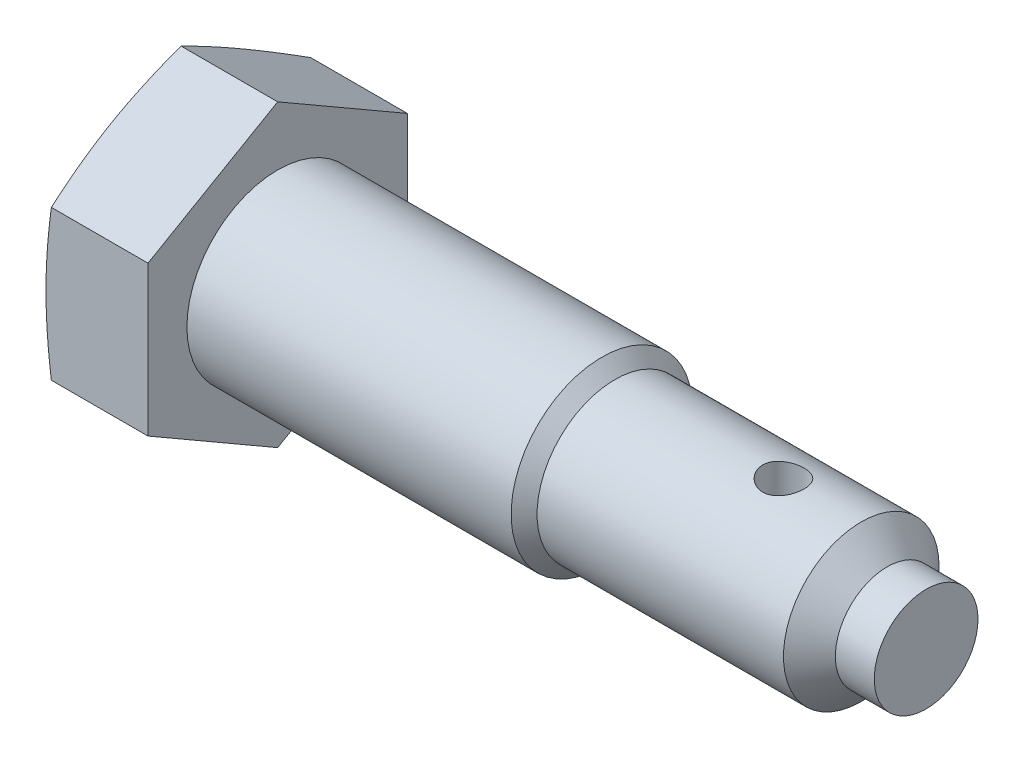
ISO-10303-21;
HEADER;
FILE_DESCRIPTION(('STEP AP214'),'2;1');
FILE_NAME('part.step','',(''),(''),'','','');
FILE_SCHEMA(('AUTOMOTIVE_DESIGN { 1 0 10303 214 1 1 1 1 }'));
ENDSEC;
DATA;
#1=APPLICATION_CONTEXT('core data for automotive mechanical design processes');
#2=APPLICATION_PROTOCOL_DEFINITION('international standard','automotive_design',2000,#1);
#3=PRODUCT_CONTEXT('',#1,'mechanical');
#4=PRODUCT('Part','Part','',(#3));
#5=PRODUCT_RELATED_PRODUCT_CATEGORY('part','',(#4));
#6=PRODUCT_DEFINITION_FORMATION('','',#4);
#7=PRODUCT_DEFINITION_CONTEXT('part definition',#1,'design');
#8=PRODUCT_DEFINITION('design','',#6,#7);
#9=PRODUCT_DEFINITION_SHAPE('','',#8);
#10=(LENGTH_UNIT() NAMED_UNIT(*) SI_UNIT(.MILLI.,.METRE.));
#11=(NAMED_UNIT(*) PLANE_ANGLE_UNIT() SI_UNIT($,.RADIAN.));
#12=(NAMED_UNIT(*) SI_UNIT($,.STERADIAN.) SOLID_ANGLE_UNIT());
#13=UNCERTAINTY_MEASURE_WITH_UNIT(LENGTH_MEASURE(1.E-05),#10,'distance_accuracy_value','');
#14=(GEOMETRIC_REPRESENTATION_CONTEXT(3) GLOBAL_UNCERTAINTY_ASSIGNED_CONTEXT((#13)) GLOBAL_UNIT_ASSIGNED_CONTEXT((#10,
#11,#12)) REPRESENTATION_CONTEXT('',''));
#15=CARTESIAN_POINT('',(0.,0.,0.));
#16=DIRECTION('',(0.,0.,1.));
#17=DIRECTION('',(1.,0.,0.));
#18=AXIS2_PLACEMENT_3D('',#15,#16,#17);
#19=CARTESIAN_POINT('',(0.,0.,0.));
#20=DIRECTION('',(1.,0.,0.));
#21=DIRECTION('',(0.,0.,-1.));
#22=AXIS2_PLACEMENT_3D('',#19,#20,#21);
#23=CYLINDRICAL_SURFACE('',#22,3.5);
#24=CARTESIAN_POINT('',(0.,0.,0.));
#25=DIRECTION('',(-1.,0.,0.));
#26=DIRECTION('',(0.,0.,1.));
#27=AXIS2_PLACEMENT_3D('',#24,#25,#26);
#28=CIRCLE('',#27,3.5);
#29=CARTESIAN_POINT('',(0.,0.,3.5));
#30=VERTEX_POINT('',#29);
#31=EDGE_CURVE('E121',#30,#30,#28,.F.);
#32=ORIENTED_EDGE('',*,*,#31,.T.);
#33=EDGE_LOOP('',(#32));
#34=FACE_BOUND('',#33,.T.);
#35=CARTESIAN_POINT('',(12.5,0.,0.));
#36=DIRECTION('',(1.,0.,0.));
#37=DIRECTION('',(0.,0.,-1.));
#38=AXIS2_PLACEMENT_3D('',#35,#36,#37);
#39=CIRCLE('',#38,3.5);
#40=CARTESIAN_POINT('',(12.5,0.,-3.5));
#41=VERTEX_POINT('',#40);
#42=EDGE_CURVE('E11',#41,#41,#39,.T.);
#43=ORIENTED_EDGE('',*,*,#42,.F.);
#44=EDGE_LOOP('',(#43));
#45=FACE_BOUND('',#44,.T.);
#46=ADVANCED_FACE('F38',(#34,#45),#23,.T.);
#47=CARTESIAN_POINT('',(13.,0.,0.));
#48=DIRECTION('',(-1.,0.,0.));
#49=DIRECTION('',(0.,0.,1.));
#50=AXIS2_PLACEMENT_3D('',#47,#48,#49);
#51=CONICAL_SURFACE('',#50,3.,0.785398163397473);
#52=ORIENTED_EDGE('',*,*,#42,.T.);
#53=EDGE_LOOP('',(#52));
#54=FACE_BOUND('',#53,.T.);
#55=CARTESIAN_POINT('',(13.,0.,0.));
#56=DIRECTION('',(1.,0.,0.));
#57=DIRECTION('',(0.,0.,-1.));
#58=AXIS2_PLACEMENT_3D('',#55,#56,#57);
#59=CIRCLE('',#58,3.);
#60=CARTESIAN_POINT('',(13.,0.,-3.));
#61=VERTEX_POINT('',#60);
#62=EDGE_CURVE('E50',#61,#61,#59,.T.);
#63=ORIENTED_EDGE('',*,*,#62,.F.);
#64=EDGE_LOOP('',(#63));
#65=FACE_BOUND('',#64,.T.);
#66=ADVANCED_FACE('F215',(#54,#65),#51,.T.);
#67=CARTESIAN_POINT('',(0.,0.,0.));
#68=DIRECTION('',(1.,0.,0.));
#69=DIRECTION('',(0.,0.,-1.));
#70=AXIS2_PLACEMENT_3D('',#67,#68,#69);
#71=CYLINDRICAL_SURFACE('',#70,3.);
#72=CARTESIAN_POINT('',(19.5,-2.89136645896019,0.799999999999999));
#73=CARTESIAN_POINT('',(19.4559296249161,-2.89136722297506,0.799998937264903));
#74=CARTESIAN_POINT('',(19.4118479998448,-2.89238505896883,0.796345972907145));
#75=CARTESIAN_POINT('',(19.3249578314098,-2.89633424540265,0.781858333049021));
#76=CARTESIAN_POINT('',(19.2821499380152,-2.89926655584148,0.77102005448496));
#77=CARTESIAN_POINT('',(19.1990767720099,-2.90668950049836,0.74254338223744));
#78=CARTESIAN_POINT('',(19.1588080164656,-2.91117794268077,0.724914550167945));
#79=CARTESIAN_POINT('',(19.0817933039791,-2.92120461973766,0.683387138255579));
#80=CARTESIAN_POINT('',(19.045047620998,-2.92674293615287,0.659488071366006));
#81=CARTESIAN_POINT('',(18.9752029812041,-2.93840055819835,0.605459391498027));
#82=CARTESIAN_POINT('',(18.942205193014,-2.94453016446161,0.575201190016778));
#83=CARTESIAN_POINT('',(18.8816873692198,-2.95659080575019,0.509589709136142));
#84=CARTESIAN_POINT('',(18.8541679015433,-2.96252182013488,0.474235902138674));
#85=CARTESIAN_POINT('',(18.8049660246388,-2.97363195387254,0.398735268349294));
#86=CARTESIAN_POINT('',(18.7833841925468,-2.97879750504887,0.358520727951789));
#87=CARTESIAN_POINT('',(18.7473261458531,-2.98767650484764,0.274873217891643));
#88=CARTESIAN_POINT('',(18.7328487330874,-2.99139019830513,0.231440792350045));
#89=CARTESIAN_POINT('',(18.7117379119057,-2.99687421430577,0.143646384724038));
#90=CARTESIAN_POINT('',(18.7049324093496,-2.99868710700104,0.0993284896803692));
#91=CARTESIAN_POINT('',(18.6988171519571,-3.00031409847102,0.0101454214034335));
#92=CARTESIAN_POINT('',(18.6995061425479,-3.00012853178644,-0.0347196589754088));
#93=CARTESIAN_POINT('',(18.7082391250158,-2.99781070343906,-0.122525694844536));
#94=CARTESIAN_POINT('',(18.7160971830545,-2.99572765610801,-0.165486640288441));
#95=CARTESIAN_POINT('',(18.7386448551128,-2.98990699436187,-0.249456526228419));
#96=CARTESIAN_POINT('',(18.7533348586744,-2.98616928560232,-0.29046535527223));
#97=CARTESIAN_POINT('',(18.789271939037,-2.97738627639961,-0.36984157805902));
#98=CARTESIAN_POINT('',(18.8105827228403,-2.97232835151086,-0.408178674531815));
#99=CARTESIAN_POINT('',(18.8591075278036,-2.96144987403785,-0.480795999505805));
#100=CARTESIAN_POINT('',(18.8863226996113,-2.95562917289138,-0.515075435234341));
#101=CARTESIAN_POINT('',(18.9468707431736,-2.94364509175552,-0.579714147786241));
#102=CARTESIAN_POINT('',(18.9803657780198,-2.93747667747739,-0.609920768071095));
#103=CARTESIAN_POINT('',(19.0520098704955,-2.92565362009165,-0.664325328419074));
#104=CARTESIAN_POINT('',(19.0901592116801,-2.91999900832316,-0.688522902119217));
#105=CARTESIAN_POINT('',(19.1703600407286,-2.90982360913227,-0.730338716745105));
#106=CARTESIAN_POINT('',(19.2124341403655,-2.90531002840292,-0.747915466402144));
#107=CARTESIAN_POINT('',(19.2990905997818,-2.89801730031578,-0.775696006742653));
#108=CARTESIAN_POINT('',(19.3436723345794,-2.89523772285943,-0.785901625845208));
#109=CARTESIAN_POINT('',(19.4326508844086,-2.89181934257617,-0.798387028371088));
#110=CARTESIAN_POINT('',(19.4770134194443,-2.89111905331079,-0.800894530484869));
#111=CARTESIAN_POINT('',(19.565523909121,-2.89177031401857,-0.798539924492));
#112=CARTESIAN_POINT('',(19.6096718860969,-2.89312164562678,-0.793678600688865));
#113=CARTESIAN_POINT('',(19.695622637639,-2.89766449715693,-0.776925087479655));
#114=CARTESIAN_POINT('',(19.7374541751755,-2.90082015876542,-0.765169791651626));
#115=CARTESIAN_POINT('',(19.8185518525433,-2.90858107584293,-0.735115946901958));
#116=CARTESIAN_POINT('',(19.8578176565708,-2.91318652060286,-0.716816543506621));
#117=CARTESIAN_POINT('',(19.9336219829743,-2.92345428988315,-0.673731622034811));
#118=CARTESIAN_POINT('',(19.9700815903559,-2.9291376194891,-0.648812380951693));
#119=CARTESIAN_POINT('',(20.0383853206812,-2.94087136773703,-0.593360911950064));
#120=CARTESIAN_POINT('',(20.0702285739816,-2.9469218552416,-0.562827628891867));
#121=CARTESIAN_POINT('',(20.1293409893,-2.95891985953717,-0.495961513001936));
#122=CARTESIAN_POINT('',(20.1564513507914,-2.96485934609522,-0.45948656640354));
#123=CARTESIAN_POINT('',(20.2041643949642,-2.97578668006869,-0.382371374376299));
#124=CARTESIAN_POINT('',(20.2247674240316,-2.98077457813167,-0.341731350807556));
#125=CARTESIAN_POINT('',(20.2586918529446,-2.989204603597,-0.257725653930351));
#126=CARTESIAN_POINT('',(20.2720676077774,-2.99265823392154,-0.214383141152936));
#127=CARTESIAN_POINT('',(20.2913154912257,-2.99768121514899,-0.125959753892531));
#128=CARTESIAN_POINT('',(20.2971892827099,-2.99925098361988,-0.0808792669281026));
#129=CARTESIAN_POINT('',(20.3011623294966,-3.0003096537508,0.00825680053845938));
#130=CARTESIAN_POINT('',(20.2994945276525,-2.99986090515248,0.0523014046111519));
#131=CARTESIAN_POINT('',(20.2889726025699,-2.9970739639153,0.139459321852275));
#132=CARTESIAN_POINT('',(20.2801187491532,-2.99473584221861,0.182572669925089));
#133=CARTESIAN_POINT('',(20.2556077580325,-2.98844524156423,0.266364049385715));
#134=CARTESIAN_POINT('',(20.2399978826108,-2.9845039887589,0.307056804740739));
#135=CARTESIAN_POINT('',(20.2024601593017,-2.975419266064,0.385268839388413));
#136=CARTESIAN_POINT('',(20.1805314253556,-2.97027562758963,0.422787672664389));
#137=CARTESIAN_POINT('',(20.1302966911445,-2.95916532490408,0.494671307469946));
#138=CARTESIAN_POINT('',(20.1018362477178,-2.95318037351521,0.528925344695138));
#139=CARTESIAN_POINT('',(20.0396389002568,-2.94113600028036,0.592250148622713));
#140=CARTESIAN_POINT('',(20.0059006096824,-2.93507655925178,0.621319548965407));
#141=CARTESIAN_POINT('',(19.9332126416638,-2.92341583866508,0.674082800936312));
#142=CARTESIAN_POINT('',(19.8941646745005,-2.91782756531167,0.697644377069544));
#143=CARTESIAN_POINT('',(19.8125174756186,-2.90792557601372,0.737834756144798));
#144=CARTESIAN_POINT('',(19.7699205885736,-2.90361102698333,0.754468093475427));
#145=CARTESIAN_POINT('',(19.6895674655868,-2.89734400254551,0.778152497005276));
#146=CARTESIAN_POINT('',(19.6521594941806,-2.89512056111167,0.786326073597102));
#147=CARTESIAN_POINT('',(19.5765037767992,-2.8921315408234,0.79724997717637));
#148=CARTESIAN_POINT('',(19.5382561270788,-2.89136579574256,0.800000922527407));
#149=CARTESIAN_POINT('',(19.5,-2.89136645896019,0.799999999999999));
#150=B_SPLINE_CURVE_WITH_KNOTS('',3,(#72,#73,#74,#75,#76,#77,#78,#79,#80,#81,#82,#83,#84,#85,
#86,#87,#88,#89,#90,#91,#92,#93,#94,#95,#96,#97,#98,#99,#100,#101,#102,#103,#104,#105,#106,#107,
#108,#109,#110,#111,#112,#113,#114,#115,#116,#117,#118,#119,#120,#121,#122,#123,#124,#125,#126,
#127,#128,#129,#130,#131,#132,#133,#134,#135,#136,#137,#138,#139,#140,#141,#142,#143,#144,#145,
#146,#147,#148,#149),.UNSPECIFIED.,.T.,.F.,(4,2,2,2,2,2,2,2,2,2,2,2,2,2,2,2,2,2,2,2,2,2,2,2,2,2,
2,2,2,2,2,2,2,2,2,2,2,2,4),(0.,0.132070451229524,0.264207179107364,0.396158524605751,
0.528120122591698,0.663063664488126,0.798021188465128,0.935140829450495,1.07223733718426,
1.2061932172332,1.34012667350969,1.4706822831705,1.60124533773006,1.73310579558957,
1.86499197354525,2.0009270491686,2.1368704105256,2.27365206035343,2.41039976964131,
2.54306133692496,2.67570878532057,2.80580740167686,2.93592301140585,3.06889853981765,
3.20189908611246,3.33874362778509,3.47558088397897,3.61137415831216,3.74713732778258,
3.87873621961241,4.01033017039841,4.14101805942122,4.27172428301041,4.40591541591286,
4.54014186147075,4.67732015588442,4.81440852834153,4.92906787062243,5.04371413709889),.UNSPECIFIED.);
#151=CARTESIAN_POINT('',(19.5,-2.89136645896019,0.799999999999999));
#152=VERTEX_POINT('',#151);
#153=EDGE_CURVE('E41',#152,#152,#150,.T.);
#154=ORIENTED_EDGE('',*,*,#153,.F.);
#155=EDGE_LOOP('',(#154));
#156=FACE_BOUND('',#155,.T.);
#157=CARTESIAN_POINT('',(19.5,2.89136645896019,0.799999999999999));
#158=CARTESIAN_POINT('',(19.5440703750839,2.89136722297506,0.799998937264903));
#159=CARTESIAN_POINT('',(19.5881520001552,2.89238505896883,0.796345972907145));
#160=CARTESIAN_POINT('',(19.6750421685902,2.89633424540265,0.781858333049021));
#161=CARTESIAN_POINT('',(19.7178500619848,2.89926655584148,0.77102005448496));
#162=CARTESIAN_POINT('',(19.8009232279901,2.90668950049836,0.74254338223744));
#163=CARTESIAN_POINT('',(19.8411919835344,2.91117794268077,0.724914550167945));
#164=CARTESIAN_POINT('',(19.9182066960209,2.92120461973766,0.683387138255579));
#165=CARTESIAN_POINT('',(19.954952379002,2.92674293615287,0.659488071366006));
#166=CARTESIAN_POINT('',(20.0247970187959,2.93840055819835,0.605459391498027));
#167=CARTESIAN_POINT('',(20.057794806986,2.94453016446161,0.575201190016778));
#168=CARTESIAN_POINT('',(20.1183126307803,2.95659080575019,0.509589709136142));
#169=CARTESIAN_POINT('',(20.1458320984567,2.96252182013488,0.474235902138674));
#170=CARTESIAN_POINT('',(20.1950339753612,2.97363195387254,0.398735268349293));
#171=CARTESIAN_POINT('',(20.2166158074532,2.97879750504887,0.358520727951788));
#172=CARTESIAN_POINT('',(20.2526738541469,2.98767650484764,0.274873217891642));
#173=CARTESIAN_POINT('',(20.2671512669126,2.99139019830513,0.231440792350045));
#174=CARTESIAN_POINT('',(20.2882620880943,2.99687421430577,0.143646384724038));
#175=CARTESIAN_POINT('',(20.2950675906504,2.99868710700104,0.0993284896803693));
#176=CARTESIAN_POINT('',(20.3011828480429,3.00031409847102,0.0101454214034335));
#177=CARTESIAN_POINT('',(20.3004938574521,3.00012853178644,-0.0347196589754088));
#178=CARTESIAN_POINT('',(20.2917608749842,2.99781070343906,-0.122525694844536));
#179=CARTESIAN_POINT('',(20.2839028169455,2.99572765610801,-0.165486640288441));
#180=CARTESIAN_POINT('',(20.2613551448872,2.98990699436187,-0.249456526228419));
#181=CARTESIAN_POINT('',(20.2466651413256,2.98616928560232,-0.29046535527223));
#182=CARTESIAN_POINT('',(20.2107280609631,2.97738627639961,-0.369841578059019));
#183=CARTESIAN_POINT('',(20.1894172771597,2.97232835151086,-0.408178674531814));
#184=CARTESIAN_POINT('',(20.1408924721964,2.96144987403785,-0.480795999505803));
#185=CARTESIAN_POINT('',(20.1136773003887,2.95562917289138,-0.515075435234341));
#186=CARTESIAN_POINT('',(20.0531292568264,2.94364509175552,-0.579714147786241));
#187=CARTESIAN_POINT('',(20.0196342219802,2.93747667747739,-0.609920768071095));
#188=CARTESIAN_POINT('',(19.9479901295045,2.92565362009165,-0.664325328419074));
#189=CARTESIAN_POINT('',(19.9098407883199,2.91999900832316,-0.688522902119217));
#190=CARTESIAN_POINT('',(19.8296399592714,2.90982360913227,-0.730338716745105));
#191=CARTESIAN_POINT('',(19.7875658596345,2.90531002840292,-0.747915466402144));
#192=CARTESIAN_POINT('',(19.7009094002182,2.89801730031578,-0.775696006742653));
#193=CARTESIAN_POINT('',(19.6563276654206,2.89523772285943,-0.785901625845208));
#194=CARTESIAN_POINT('',(19.5673491155914,2.89181934257617,-0.798387028371088));
#195=CARTESIAN_POINT('',(19.5229865805557,2.89111905331079,-0.800894530484869));
#196=CARTESIAN_POINT('',(19.434476090879,2.89177031401857,-0.798539924492));
#197=CARTESIAN_POINT('',(19.3903281139031,2.89312164562678,-0.793678600688865));
#198=CARTESIAN_POINT('',(19.304377362361,2.89766449715693,-0.776925087479655));
#199=CARTESIAN_POINT('',(19.2625458248245,2.90082015876542,-0.765169791651626));
#200=CARTESIAN_POINT('',(19.1814481474567,2.90858107584293,-0.735115946901959));
#201=CARTESIAN_POINT('',(19.1421823434292,2.91318652060286,-0.716816543506622));
#202=CARTESIAN_POINT('',(19.0663780170257,2.92345428988315,-0.673731622034812));
#203=CARTESIAN_POINT('',(19.0299184096441,2.9291376194891,-0.648812380951694));
#204=CARTESIAN_POINT('',(18.9616146793188,2.94087136773703,-0.593360911950066));
#205=CARTESIAN_POINT('',(18.9297714260184,2.9469218552416,-0.562827628891869));
#206=CARTESIAN_POINT('',(18.8706590107,2.95891985953717,-0.495961513001937));
#207=CARTESIAN_POINT('',(18.8435486492086,2.96485934609522,-0.45948656640354));
#208=CARTESIAN_POINT('',(18.7958356050358,2.97578668006869,-0.382371374376299));
#209=CARTESIAN_POINT('',(18.7752325759684,2.98077457813167,-0.341731350807556));
#210=CARTESIAN_POINT('',(18.7413081470554,2.989204603597,-0.257725653930351));
#211=CARTESIAN_POINT('',(18.7279323922226,2.99265823392154,-0.214383141152936));
#212=CARTESIAN_POINT('',(18.7086845087743,2.99768121514899,-0.125959753892531));
#213=CARTESIAN_POINT('',(18.7028107172901,2.99925098361988,-0.0808792669281023));
#214=CARTESIAN_POINT('',(18.6988376705034,3.0003096537508,0.00825680053845938));
#215=CARTESIAN_POINT('',(18.7005054723475,2.99986090515248,0.0523014046111519));
#216=CARTESIAN_POINT('',(18.7110273974301,2.9970739639153,0.139459321852275));
#217=CARTESIAN_POINT('',(18.7198812508468,2.99473584221861,0.182572669925089));
#218=CARTESIAN_POINT('',(18.7443922419675,2.98844524156423,0.266364049385715));
#219=CARTESIAN_POINT('',(18.7600021173892,2.9845039887589,0.307056804740738));
#220=CARTESIAN_POINT('',(18.7975398406983,2.975419266064,0.385268839388412));
#221=CARTESIAN_POINT('',(18.8194685746444,2.97027562758963,0.422787672664389));
#222=CARTESIAN_POINT('',(18.8697033088555,2.95916532490408,0.494671307469946));
#223=CARTESIAN_POINT('',(18.8981637522822,2.95318037351521,0.528925344695138));
#224=CARTESIAN_POINT('',(18.9603610997432,2.94113600028036,0.592250148622713));
#225=CARTESIAN_POINT('',(18.9940993903176,2.93507655925178,0.621319548965407));
#226=CARTESIAN_POINT('',(19.0667873583362,2.92341583866508,0.674082800936311));
#227=CARTESIAN_POINT('',(19.1058353254995,2.91782756531167,0.697644377069543));
#228=CARTESIAN_POINT('',(19.1874825243814,2.90792557601372,0.737834756144797));
#229=CARTESIAN_POINT('',(19.2300794114264,2.90361102698333,0.754468093475427));
#230=CARTESIAN_POINT('',(19.3104325344132,2.89734400254551,0.778152497005276));
#231=CARTESIAN_POINT('',(19.3478405058194,2.89512056111167,0.786326073597102));
#232=CARTESIAN_POINT('',(19.4234962232008,2.8921315408234,0.79724997717637));
#233=CARTESIAN_POINT('',(19.4617438729212,2.89136579574256,0.800000922527407));
#234=CARTESIAN_POINT('',(19.5,2.89136645896019,0.799999999999999));
#235=B_SPLINE_CURVE_WITH_KNOTS('',3,(#157,#158,#159,#160,#161,#162,#163,#164,#165,#166,#167,
#168,#169,#170,#171,#172,#173,#174,#175,#176,#177,#178,#179,#180,#181,#182,#183,#184,#185,#186,
#187,#188,#189,#190,#191,#192,#193,#194,#195,#196,#197,#198,#199,#200,#201,#202,#203,#204,#205,
#206,#207,#208,#209,#210,#211,#212,#213,#214,#215,#216,#217,#218,#219,#220,#221,#222,#223,#224,
#225,#226,#227,#228,#229,#230,#231,#232,#233,#234),.UNSPECIFIED.,.T.,.F.,(4,2,2,2,2,2,2,2,2,2,2,
2,2,2,2,2,2,2,2,2,2,2,2,2,2,2,2,2,2,2,2,2,2,2,2,2,2,2,4),(0.,0.132070451229524,
0.264207179107364,0.396158524605751,0.528120122591698,0.663063664488126,0.798021188465128,
0.935140829450496,1.07223733718426,1.2061932172332,1.34012667350969,1.4706822831705,
1.60124533773006,1.73310579558956,1.86499197354525,2.0009270491686,2.1368704105256,
2.27365206035343,2.41039976964131,2.54306133692496,2.67570878532057,2.80580740167685,
2.93592301140585,3.06889853981764,3.20189908611246,3.33874362778509,3.47558088397897,
3.61137415831216,3.74713732778258,3.87873621961241,4.01033017039841,4.14101805942122,
4.27172428301041,4.40591541591286,4.54014186147075,4.67732015588441,4.81440852834153,
4.92906787062243,5.04371413709889),.UNSPECIFIED.);
#236=CARTESIAN_POINT('',(19.5,2.89136645896019,0.799999999999999));
#237=VERTEX_POINT('',#236);
#238=EDGE_CURVE('E139',#237,#237,#235,.T.);
#239=ORIENTED_EDGE('',*,*,#238,.F.);
#240=EDGE_LOOP('',(#239));
#241=FACE_BOUND('',#240,.T.);
#242=ORIENTED_EDGE('',*,*,#62,.T.);
#243=EDGE_LOOP('',(#242));
#244=FACE_BOUND('',#243,.T.);
#245=CARTESIAN_POINT('',(22.5,0.,0.));
#246=DIRECTION('',(1.,0.,0.));
#247=DIRECTION('',(0.,0.,-1.));
#248=AXIS2_PLACEMENT_3D('',#245,#246,#247);
#249=CIRCLE('',#248,3.);
#250=CARTESIAN_POINT('',(22.5,0.,-3.));
#251=VERTEX_POINT('',#250);
#252=EDGE_CURVE('E135',#251,#251,#249,.T.);
#253=ORIENTED_EDGE('',*,*,#252,.F.);
#254=EDGE_LOOP('',(#253));
#255=FACE_BOUND('',#254,.T.);
#256=ADVANCED_FACE('F143',(#156,#241,#244,#255),#71,.T.);
#257=CARTESIAN_POINT('',(23.5,0.,0.));
#258=DIRECTION('',(-1.,0.,0.));
#259=DIRECTION('',(0.,0.,1.));
#260=AXIS2_PLACEMENT_3D('',#257,#258,#259);
#261=CONICAL_SURFACE('',#260,2.00000000000001,0.785398163397464);
#262=ORIENTED_EDGE('',*,*,#252,.T.);
#263=EDGE_LOOP('',(#262));
#264=FACE_BOUND('',#263,.T.);
#265=CARTESIAN_POINT('',(23.5,0.,0.));
#266=DIRECTION('',(1.,0.,0.));
#267=DIRECTION('',(0.,0.,-1.));
#268=AXIS2_PLACEMENT_3D('',#265,#266,#267);
#269=CIRCLE('',#268,2.00000000000001);
#270=CARTESIAN_POINT('',(23.5,0.,-2.00000000000001));
#271=VERTEX_POINT('',#270);
#272=EDGE_CURVE('E132',#271,#271,#269,.T.);
#273=ORIENTED_EDGE('',*,*,#272,.F.);
#274=EDGE_LOOP('',(#273));
#275=FACE_BOUND('',#274,.T.);
#276=ADVANCED_FACE('F208',(#264,#275),#261,.T.);
#277=CARTESIAN_POINT('',(0.,0.,0.));
#278=DIRECTION('',(1.,0.,0.));
#279=DIRECTION('',(0.,0.,-1.));
#280=AXIS2_PLACEMENT_3D('',#277,#278,#279);
#281=CYLINDRICAL_SURFACE('',#280,2.00000000000001);
#282=ORIENTED_EDGE('',*,*,#272,.T.);
#283=EDGE_LOOP('',(#282));
#284=FACE_BOUND('',#283,.T.);
#285=CARTESIAN_POINT('',(25.,0.,0.));
#286=DIRECTION('',(1.,0.,0.));
#287=DIRECTION('',(0.,0.,-1.));
#288=AXIS2_PLACEMENT_3D('',#285,#286,#287);
#289=CIRCLE('',#288,2.00000000000001);
#290=CARTESIAN_POINT('',(25.,0.,-2.00000000000001));
#291=VERTEX_POINT('',#290);
#292=EDGE_CURVE('E129',#291,#291,#289,.T.);
#293=ORIENTED_EDGE('',*,*,#292,.F.);
#294=EDGE_LOOP('',(#293));
#295=FACE_BOUND('',#294,.T.);
#296=ADVANCED_FACE('F205',(#284,#295),#281,.T.);
#297=CARTESIAN_POINT('',(25.,2.00000000000001,0.));
#298=DIRECTION('',(1.,0.,0.));
#299=DIRECTION('',(0.,0.,-1.));
#300=AXIS2_PLACEMENT_3D('',#297,#298,#299);
#301=PLANE('',#300);
#302=ORIENTED_EDGE('',*,*,#292,.T.);
#303=EDGE_LOOP('',(#302));
#304=FACE_BOUND('',#303,.T.);
#305=ADVANCED_FACE('F202',(#304),#301,.T.);
#306=CARTESIAN_POINT('',(-4.,2.88675134594814,5.));
#307=DIRECTION('',(0.,-0.866025403784439,-0.5));
#308=DIRECTION('',(0.,0.5,-0.866025403784439));
#309=AXIS2_PLACEMENT_3D('',#306,#307,#308);
#310=PLANE('',#309);
#311=DIRECTION('',(1.,0.,0.));
#312=VECTOR('',#311,1.);
#313=CARTESIAN_POINT('',(-4.,5.77350269189627,0.));
#314=LINE('',#313,#312);
#315=CARTESIAN_POINT('',(-3.72575328025532,5.77350269189627,0.));
#316=VERTEX_POINT('',#315);
#317=CARTESIAN_POINT('',(0.,5.77350269189627,0.));
#318=VERTEX_POINT('',#317);
#319=EDGE_CURVE('E119',#316,#318,#314,.T.);
#320=ORIENTED_EDGE('',*,*,#319,.F.);
#321=CARTESIAN_POINT('',(-3.72572233921946,5.7736181619501,-0.000199999999999651));
#322=CARTESIAN_POINT('',(-3.75786060570922,5.65372906666592,0.207454004305665));
#323=CARTESIAN_POINT('',(-3.78703688886878,5.5336225933968,0.415484518325708));
#324=CARTESIAN_POINT('',(-3.83829693171217,5.29298546611233,0.832280248969819));
#325=CARTESIAN_POINT('',(-3.86037781032306,5.17245465982903,1.04104572932974));
#326=CARTESIAN_POINT('',(-3.89615793404602,4.93169967308863,1.45804559853969));
#327=CARTESIAN_POINT('',(-3.90989985002543,4.8114771207458,1.66627716741308));
#328=CARTESIAN_POINT('',(-3.92832635768827,4.57087869579028,2.08300586365708));
#329=CARTESIAN_POINT('',(-3.93301270189222,4.45050285735624,2.29150293182854));
#330=CARTESIAN_POINT('',(-3.93301270189222,4.20975118048816,2.70849706817146));
#331=CARTESIAN_POINT('',(-3.92832635768827,4.08937534205413,2.91699413634291));
#332=CARTESIAN_POINT('',(-3.90989985002543,3.84877691709861,3.33372283258692));
#333=CARTESIAN_POINT('',(-3.89615793404603,3.72855436475578,3.54195440146031));
#334=CARTESIAN_POINT('',(-3.86037781032306,3.48779937801537,3.95895427067026));
#335=CARTESIAN_POINT('',(-3.83829693171217,3.36726857173207,4.16771975103018));
#336=CARTESIAN_POINT('',(-3.78703688886879,3.12663144444761,4.58451548167429));
#337=CARTESIAN_POINT('',(-3.75786060570922,3.00652497117848,4.79254599569433));
#338=CARTESIAN_POINT('',(-3.72572233921946,2.8866358758943,5.0002));
#339=B_SPLINE_CURVE_WITH_KNOTS('',3,(#321,#322,#323,#324,#325,#326,#327,#328,#329,#330,#331,
#332,#333,#334,#335,#336,#337,#338),.UNSPECIFIED.,.F.,.F.,(4,2,2,2,2,2,2,2,4),(0.,
0.725805237679807,1.45190481561531,2.17425686883392,2.89646911159516,3.6186813543564,
4.341033407575,5.06713298551051,5.79293822319032),.UNSPECIFIED.);
#340=CARTESIAN_POINT('',(-3.72575328025532,2.88675134594815,5.));
#341=VERTEX_POINT('',#340);
#342=EDGE_CURVE('E101',#316,#341,#339,.T.);
#343=ORIENTED_EDGE('',*,*,#342,.T.);
#344=DIRECTION('',(1.,0.,0.));
#345=VECTOR('',#344,1.);
#346=CARTESIAN_POINT('',(-4.,2.88675134594814,5.));
#347=LINE('',#346,#345);
#348=CARTESIAN_POINT('',(0.,2.88675134594814,5.));
#349=VERTEX_POINT('',#348);
#350=EDGE_CURVE('E66',#341,#349,#347,.T.);
#351=ORIENTED_EDGE('',*,*,#350,.T.);
#352=DIRECTION('',(0.,0.5,-0.866025403784439));
#353=VECTOR('',#352,1.);
#354=CARTESIAN_POINT('',(0.,2.88675134594814,5.));
#355=LINE('',#354,#353);
#356=EDGE_CURVE('E238',#349,#318,#355,.T.);
#357=ORIENTED_EDGE('',*,*,#356,.T.);
#358=EDGE_LOOP('',(#320,#343,#351,#357));
#359=FACE_BOUND('',#358,.T.);
#360=ADVANCED_FACE('F197',(#359),#310,.F.);
#361=CARTESIAN_POINT('',(-4.,5.77350269189627,0.));
#362=DIRECTION('',(0.,-0.866025403784439,0.5));
#363=DIRECTION('',(0.,-0.5,-0.866025403784438));
#364=AXIS2_PLACEMENT_3D('',#361,#362,#363);
#365=PLANE('',#364);
#366=DIRECTION('',(1.,0.,0.));
#367=VECTOR('',#366,1.);
#368=CARTESIAN_POINT('',(-4.,2.88675134594813,-5.));
#369=LINE('',#368,#367);
#370=CARTESIAN_POINT('',(-3.72575328025532,2.88675134594814,-5.));
#371=VERTEX_POINT('',#370);
#372=CARTESIAN_POINT('',(0.,2.88675134594813,-5.));
#373=VERTEX_POINT('',#372);
#374=EDGE_CURVE('E110',#371,#373,#369,.T.);
#375=ORIENTED_EDGE('',*,*,#374,.F.);
#376=CARTESIAN_POINT('',(-3.72572233921946,2.8866358758943,-5.0002));
#377=CARTESIAN_POINT('',(-3.75786060570922,3.00652497117848,-4.79254599569434));
#378=CARTESIAN_POINT('',(-3.78703688886878,3.1266314444476,-4.58451548167429));
#379=CARTESIAN_POINT('',(-3.83829693171217,3.36726857173207,-4.16771975103018));
#380=CARTESIAN_POINT('',(-3.86037781032306,3.48779937801537,-3.95895427067026));
#381=CARTESIAN_POINT('',(-3.89615793404603,3.72855436475578,-3.54195440146031));
#382=CARTESIAN_POINT('',(-3.90989985002543,3.8487769170986,-3.33372283258692));
#383=CARTESIAN_POINT('',(-3.92832635768827,4.08937534205412,-2.91699413634292));
#384=CARTESIAN_POINT('',(-3.93301270189222,4.20975118048816,-2.70849706817146));
#385=CARTESIAN_POINT('',(-3.93301270189222,4.45050285735624,-2.29150293182854));
#386=CARTESIAN_POINT('',(-3.92832635768827,4.57087869579028,-2.08300586365709));
#387=CARTESIAN_POINT('',(-3.90989985002543,4.8114771207458,-1.66627716741308));
#388=CARTESIAN_POINT('',(-3.89615793404602,4.93169967308862,-1.45804559853969));
#389=CARTESIAN_POINT('',(-3.86037781032306,5.17245465982903,-1.04104572932974));
#390=CARTESIAN_POINT('',(-3.83829693171217,5.29298546611233,-0.832280248969818));
#391=CARTESIAN_POINT('',(-3.78703688886878,5.5336225933968,-0.415484518325708));
#392=CARTESIAN_POINT('',(-3.75786060570922,5.65372906666593,-0.207454004305664));
#393=CARTESIAN_POINT('',(-3.72572233921946,5.7736181619501,0.000200000000000957));
#394=B_SPLINE_CURVE_WITH_KNOTS('',3,(#376,#377,#378,#379,#380,#381,#382,#383,#384,#385,#386,
#387,#388,#389,#390,#391,#392,#393),.UNSPECIFIED.,.F.,.F.,(4,2,2,2,2,2,2,2,4),(0.,
0.725805237679808,1.45190481561532,2.17425686883392,2.89646911159516,3.6186813543564,
4.34103340757501,5.06713298551052,5.79293822319033),.UNSPECIFIED.);
#395=EDGE_CURVE('E96',#371,#316,#394,.T.);
#396=ORIENTED_EDGE('',*,*,#395,.T.);
#397=ORIENTED_EDGE('',*,*,#319,.T.);
#398=DIRECTION('',(0.,-0.5,-0.866025403784438));
#399=VECTOR('',#398,1.);
#400=CARTESIAN_POINT('',(0.,5.77350269189627,0.));
#401=LINE('',#400,#399);
#402=EDGE_CURVE('E117',#318,#373,#401,.T.);
#403=ORIENTED_EDGE('',*,*,#402,.T.);
#404=EDGE_LOOP('',(#375,#396,#397,#403));
#405=FACE_BOUND('',#404,.T.);
#406=ADVANCED_FACE('F115',(#405),#365,.F.);
#407=CARTESIAN_POINT('',(-4.,2.88675134594813,-5.));
#408=DIRECTION('',(0.,0.,1.));
#409=DIRECTION('',(1.,0.,0.));
#410=AXIS2_PLACEMENT_3D('',#407,#408,#409);
#411=PLANE('',#410);
#412=DIRECTION('',(1.,0.,0.));
#413=VECTOR('',#412,1.);
#414=CARTESIAN_POINT('',(-4.,-2.88675134594813,-5.));
#415=LINE('',#414,#413);
#416=CARTESIAN_POINT('',(-3.72575328025532,-2.88675134594813,-5.00000000000001));
#417=VERTEX_POINT('',#416);
#418=CARTESIAN_POINT('',(0.,-2.88675134594813,-5.));
#419=VERTEX_POINT('',#418);
#420=EDGE_CURVE('E112',#417,#419,#415,.T.);
#421=ORIENTED_EDGE('',*,*,#420,.F.);
#422=CARTESIAN_POINT('',(-2.82903698755711,-7.62732617961256,-5.));
#423=CARTESIAN_POINT('',(-2.87983225468474,-7.40059318888634,-5.));
#424=CARTESIAN_POINT('',(-2.9300047473063,-7.17371812772841,-5.));
#425=CARTESIAN_POINT('',(-3.02876803568481,-6.71961411105936,-5.));
#426=CARTESIAN_POINT('',(-3.0773587628429,-6.49238514064633,-5.));
#427=CARTESIAN_POINT('',(-3.17266490541172,-6.03729879716526,-5.));
#428=CARTESIAN_POINT('',(-3.21937842333352,-5.80944102529437,-5.));
#429=CARTESIAN_POINT('',(-3.3104244597888,-5.3532505423019,-5.));
#430=CARTESIAN_POINT('',(-3.35475699851601,-5.12491783522546,-5.));
#431=CARTESIAN_POINT('',(-3.44013151570533,-4.66952201502071,-5.));
#432=CARTESIAN_POINT('',(-3.48119693838064,-4.44246331881149,-5.));
#433=CARTESIAN_POINT('',(-3.5597324688976,-3.98772607411974,-5.));
#434=CARTESIAN_POINT('',(-3.59720265609397,-3.76004753943253,-5.));
#435=CARTESIAN_POINT('',(-3.66770211626296,-3.3040274513114,-5.));
#436=CARTESIAN_POINT('',(-3.70073195065549,-3.07568598543238,-5.));
#437=CARTESIAN_POINT('',(-3.7613757016098,-2.61827673873255,-5.));
#438=CARTESIAN_POINT('',(-3.78898961348019,-2.38920895728276,-5.));
#439=CARTESIAN_POINT('',(-3.83801767084097,-1.92776610307447,-5.));
#440=CARTESIAN_POINT('',(-3.85935774714586,-1.69538304181523,-5.));
#441=CARTESIAN_POINT('',(-3.89436469593167,-1.23003470245534,-5.));
#442=CARTESIAN_POINT('',(-3.9080317443912,-0.997069437830459,-5.));
#443=CARTESIAN_POINT('',(-3.92689542592037,-0.530894496274129,-5.));
#444=CARTESIAN_POINT('',(-3.93209587865553,-0.297684977080981,-5.));
#445=CARTESIAN_POINT('',(-3.93370686337611,0.168764885440816,-5.));
#446=CARTESIAN_POINT('',(-3.93011740123438,0.402005228748767,-5.));
#447=CARTESIAN_POINT('',(-3.91435036346573,0.869040763057769,-5.));
#448=CARTESIAN_POINT('',(-3.90214152879811,1.10283487723265,-5.));
#449=CARTESIAN_POINT('',(-3.8698316201038,1.56987205570745,-5.));
#450=CARTESIAN_POINT('',(-3.8497303720246,1.80311510774058,-5.));
#451=CARTESIAN_POINT('',(-3.8026488409887,2.26904862515522,-5.));
#452=CARTESIAN_POINT('',(-3.7756640850948,2.50173863155372,-5.));
#453=CARTESIAN_POINT('',(-3.71593516460144,2.96637002674259,-5.));
#454=CARTESIAN_POINT('',(-3.68319098231101,3.19831141323121,-5.));
#455=CARTESIAN_POINT('',(-3.61529231710722,3.64627802067101,-5.));
#456=CARTESIAN_POINT('',(-3.58043694546044,3.86234902963276,-5.));
#457=CARTESIAN_POINT('',(-3.50734440935178,4.29392065190201,-5.));
#458=CARTESIAN_POINT('',(-3.46910715274809,4.50942124950339,-5.));
#459=CARTESIAN_POINT('',(-3.35027913152103,5.15520048366675,-5.));
#460=CARTESIAN_POINT('',(-3.26557772159748,5.58472103662712,-5.));
#461=CARTESIAN_POINT('',(-3.08886675878112,6.44233868675617,-5.));
#462=CARTESIAN_POINT('',(-2.99685544098619,6.87043541400407,-5.));
#463=CARTESIAN_POINT('',(-2.80784481136318,7.72549533293468,-5.));
#464=CARTESIAN_POINT('',(-2.71084579085917,8.15245858929326,-5.));
#465=CARTESIAN_POINT('',(-2.51432199269133,9.00135698456509,-5.));
#466=CARTESIAN_POINT('',(-2.41483162872711,9.42330013063735,-5.));
#467=CARTESIAN_POINT('',(-2.21336212310285,10.2665986150941,-5.));
#468=CARTESIAN_POINT('',(-2.1113829361698,10.6879539426383,-5.));
#469=CARTESIAN_POINT('',(-1.90571317871864,11.5296960367547,-5.));
#470=CARTESIAN_POINT('',(-1.80202486955214,11.9500833571164,-5.));
#471=CARTESIAN_POINT('',(-1.59323385883894,12.7904921571323,-5.));
#472=CARTESIAN_POINT('',(-1.48813120399639,13.2105136483816,-5.));
#473=CARTESIAN_POINT('',(-1.38252751097436,13.6304076579026,-5.));
#474=B_SPLINE_CURVE_WITH_KNOTS('',3,(#422,#423,#424,#425,#426,#427,#428,#429,#430,#431,#432,
#433,#434,#435,#436,#437,#438,#439,#440,#441,#442,#443,#444,#445,#446,#447,#448,#449,#450,#451,
#452,#453,#454,#455,#456,#457,#458,#459,#460,#461,#462,#463,#464,#465,#466,#467,#468,#469,#470,
#471,#472,#473),.UNSPECIFIED.,.F.,.F.,(4,2,2,2,2,2,2,2,2,2,2,2,2,2,2,2,2,2,2,2,2,2,2,2,2,4),(0.,
0.697062440503384,1.3941550714225,2.09193545716452,2.7897099239079,3.4819138119206,
4.17410241796291,4.86620342405363,5.55830502965343,6.25827664152275,6.95823219909707,
7.6578718873637,8.3575111081756,9.0597007637276,9.76190590563673,10.4645685114458,
11.1672332756296,11.8237942691338,12.4803731566151,13.7936387883007,15.1072224637455,
16.4207295017414,17.7212618348444,19.0218178429761,20.3207727983058,21.6196849646221),.UNSPECIFIED.);
#475=EDGE_CURVE('E99',#417,#371,#474,.T.);
#476=ORIENTED_EDGE('',*,*,#475,.T.);
#477=ORIENTED_EDGE('',*,*,#374,.T.);
#478=DIRECTION('',(0.,-1.,0.));
#479=VECTOR('',#478,1.);
#480=CARTESIAN_POINT('',(0.,2.88675134594813,-5.));
#481=LINE('',#480,#479);
#482=EDGE_CURVE('E241',#373,#419,#481,.T.);
#483=ORIENTED_EDGE('',*,*,#482,.T.);
#484=EDGE_LOOP('',(#421,#476,#477,#483));
#485=FACE_BOUND('',#484,.T.);
#486=ADVANCED_FACE('F108',(#485),#411,.F.);
#487=CARTESIAN_POINT('',(-4.,-2.88675134594813,-5.));
#488=DIRECTION('',(0.,0.866025403784439,0.5));
#489=DIRECTION('',(0.,-0.5,0.866025403784438));
#490=AXIS2_PLACEMENT_3D('',#487,#488,#489);
#491=PLANE('',#490);
#492=DIRECTION('',(1.,0.,0.));
#493=VECTOR('',#492,1.);
#494=CARTESIAN_POINT('',(-4.,-5.77350269189626,0.));
#495=LINE('',#494,#493);
#496=CARTESIAN_POINT('',(-3.72575328025532,-5.77350269189627,0.));
#497=VERTEX_POINT('',#496);
#498=CARTESIAN_POINT('',(0.,-5.77350269189626,0.));
#499=VERTEX_POINT('',#498);
#500=EDGE_CURVE('E123',#497,#499,#495,.T.);
#501=ORIENTED_EDGE('',*,*,#500,.F.);
#502=CARTESIAN_POINT('',(-3.72572233921946,-5.7736181619501,0.000199999999998582));
#503=CARTESIAN_POINT('',(-3.75786060570922,-5.65372906666592,-0.207454004305666));
#504=CARTESIAN_POINT('',(-3.78703688886879,-5.53362259339679,-0.41548451832571));
#505=CARTESIAN_POINT('',(-3.83829693171217,-5.29298546611233,-0.83228024896982));
#506=CARTESIAN_POINT('',(-3.86037781032306,-5.17245465982903,-1.04104572932974));
#507=CARTESIAN_POINT('',(-3.89615793404603,-4.93169967308862,-1.45804559853969));
#508=CARTESIAN_POINT('',(-3.90989985002543,-4.81147712074579,-1.66627716741308));
#509=CARTESIAN_POINT('',(-3.92832635768827,-4.57087869579027,-2.08300586365709));
#510=CARTESIAN_POINT('',(-3.93301270189222,-4.45050285735624,-2.29150293182855));
#511=CARTESIAN_POINT('',(-3.93301270189222,-4.20975118048816,-2.70849706817146));
#512=CARTESIAN_POINT('',(-3.92832635768827,-4.08937534205412,-2.91699413634292));
#513=CARTESIAN_POINT('',(-3.90989985002543,-3.8487769170986,-3.33372283258692));
#514=CARTESIAN_POINT('',(-3.89615793404603,-3.72855436475577,-3.54195440146031));
#515=CARTESIAN_POINT('',(-3.86037781032306,-3.48779937801536,-3.95895427067027));
#516=CARTESIAN_POINT('',(-3.83829693171217,-3.36726857173206,-4.16771975103019));
#517=CARTESIAN_POINT('',(-3.78703688886879,-3.1266314444476,-4.5845154816743));
#518=CARTESIAN_POINT('',(-3.75786060570922,-3.00652497117847,-4.79254599569434));
#519=CARTESIAN_POINT('',(-3.72572233921946,-2.88663587589429,-5.0002));
#520=B_SPLINE_CURVE_WITH_KNOTS('',3,(#502,#503,#504,#505,#506,#507,#508,#509,#510,#511,#512,
#513,#514,#515,#516,#517,#518,#519),.UNSPECIFIED.,.F.,.F.,(4,2,2,2,2,2,2,2,4),(0.,
0.725805237679808,1.45190481561532,2.17425686883392,2.89646911159516,3.6186813543564,
4.34103340757501,5.06713298551052,5.79293822319032),.UNSPECIFIED.);
#521=EDGE_CURVE('E113',#497,#417,#520,.T.);
#522=ORIENTED_EDGE('',*,*,#521,.T.);
#523=ORIENTED_EDGE('',*,*,#420,.T.);
#524=DIRECTION('',(0.,-0.5,0.866025403784438));
#525=VECTOR('',#524,1.);
#526=CARTESIAN_POINT('',(0.,-2.88675134594813,-5.));
#527=LINE('',#526,#525);
#528=EDGE_CURVE('E245',#419,#499,#527,.T.);
#529=ORIENTED_EDGE('',*,*,#528,.T.);
#530=EDGE_LOOP('',(#501,#522,#523,#529));
#531=FACE_BOUND('',#530,.T.);
#532=ADVANCED_FACE('F260',(#531),#491,.F.);
#533=CARTESIAN_POINT('',(-4.,-5.77350269189626,0.));
#534=DIRECTION('',(0.,0.866025403784439,-0.5));
#535=DIRECTION('',(0.,0.5,0.866025403784439));
#536=AXIS2_PLACEMENT_3D('',#533,#534,#535);
#537=PLANE('',#536);
#538=DIRECTION('',(1.,0.,0.));
#539=VECTOR('',#538,1.);
#540=CARTESIAN_POINT('',(-4.,-2.88675134594813,5.));
#541=LINE('',#540,#539);
#542=CARTESIAN_POINT('',(-3.72575328025532,-2.88675134594813,5.));
#543=VERTEX_POINT('',#542);
#544=CARTESIAN_POINT('',(0.,-2.88675134594813,5.));
#545=VERTEX_POINT('',#544);
#546=EDGE_CURVE('E253',#543,#545,#541,.T.);
#547=ORIENTED_EDGE('',*,*,#546,.F.);
#548=CARTESIAN_POINT('',(-3.72572233921946,-2.88663587589429,5.0002));
#549=CARTESIAN_POINT('',(-3.75786060570922,-3.00652497117847,4.79254599569433));
#550=CARTESIAN_POINT('',(-3.78703688886879,-3.1266314444476,4.58451548167429));
#551=CARTESIAN_POINT('',(-3.83829693171217,-3.36726857173207,4.16771975103018));
#552=CARTESIAN_POINT('',(-3.86037781032306,-3.48779937801537,3.95895427067026));
#553=CARTESIAN_POINT('',(-3.89615793404603,-3.72855436475577,3.54195440146031));
#554=CARTESIAN_POINT('',(-3.90989985002543,-3.8487769170986,3.33372283258692));
#555=CARTESIAN_POINT('',(-3.92832635768827,-4.08937534205412,2.91699413634291));
#556=CARTESIAN_POINT('',(-3.93301270189222,-4.20975118048816,2.70849706817146));
#557=CARTESIAN_POINT('',(-3.93301270189222,-4.45050285735624,2.29150293182854));
#558=CARTESIAN_POINT('',(-3.92832635768827,-4.57087869579027,2.08300586365708));
#559=CARTESIAN_POINT('',(-3.90989985002543,-4.81147712074579,1.66627716741308));
#560=CARTESIAN_POINT('',(-3.89615793404603,-4.93169967308862,1.45804559853969));
#561=CARTESIAN_POINT('',(-3.86037781032306,-5.17245465982903,1.04104572932974));
#562=CARTESIAN_POINT('',(-3.83829693171217,-5.29298546611233,0.832280248969818));
#563=CARTESIAN_POINT('',(-3.78703688886879,-5.53362259339679,0.415484518325707));
#564=CARTESIAN_POINT('',(-3.75786060570922,-5.65372906666592,0.207454004305663));
#565=CARTESIAN_POINT('',(-3.72572233921946,-5.7736181619501,-0.000200000000001829));
#566=B_SPLINE_CURVE_WITH_KNOTS('',3,(#548,#549,#550,#551,#552,#553,#554,#555,#556,#557,#558,
#559,#560,#561,#562,#563,#564,#565),.UNSPECIFIED.,.F.,.F.,(4,2,2,2,2,2,2,2,4),(0.,
0.725805237679807,1.45190481561532,2.17425686883392,2.89646911159516,3.6186813543564,
4.341033407575,5.06713298551051,5.79293822319032),.UNSPECIFIED.);
#567=EDGE_CURVE('E58',#543,#497,#566,.T.);
#568=ORIENTED_EDGE('',*,*,#567,.T.);
#569=ORIENTED_EDGE('',*,*,#500,.T.);
#570=DIRECTION('',(0.,0.5,0.866025403784439));
#571=VECTOR('',#570,1.);
#572=CARTESIAN_POINT('',(0.,-5.77350269189626,0.));
#573=LINE('',#572,#571);
#574=EDGE_CURVE('E248',#499,#545,#573,.T.);
#575=ORIENTED_EDGE('',*,*,#574,.T.);
#576=EDGE_LOOP('',(#547,#568,#569,#575));
#577=FACE_BOUND('',#576,.T.);
#578=ADVANCED_FACE('F257',(#577),#537,.F.);
#579=CARTESIAN_POINT('',(-4.,-2.88675134594813,5.));
#580=DIRECTION('',(0.,0.,-1.));
#581=DIRECTION('',(0.,1.,0.));
#582=AXIS2_PLACEMENT_3D('',#579,#580,#581);
#583=PLANE('',#582);
#584=ORIENTED_EDGE('',*,*,#350,.F.);
#585=CARTESIAN_POINT('',(-2.82903594052536,-7.6273308519514,5.));
#586=CARTESIAN_POINT('',(-2.87983125929537,-7.40059767240302,5.));
#587=CARTESIAN_POINT('',(-2.93000380337154,-7.17372242235321,5.));
#588=CARTESIAN_POINT('',(-3.0287671938951,-6.71961802765355,5.));
#589=CARTESIAN_POINT('',(-3.07735797174357,-6.49238886810177,5.));
#590=CARTESIAN_POINT('',(-3.17266421467865,-6.03730214537215,5.));
#591=CARTESIAN_POINT('',(-3.21937778227135,-5.80944418339032,5.));
#592=CARTESIAN_POINT('',(-3.31042391626108,-5.35325331970122,5.));
#593=CARTESIAN_POINT('',(-3.35475650285185,-5.12492042203908,5.));
#594=CARTESIAN_POINT('',(-3.44013111201098,-4.66952422501597,5.));
#595=CARTESIAN_POINT('',(-3.48119657885885,-4.44246534258768,5.));
#596=CARTESIAN_POINT('',(-3.5597321938505,-3.98772772463362,5.));
#597=CARTESIAN_POINT('',(-3.59720242134919,-3.76004900290321,5.));
#598=CARTESIAN_POINT('',(-3.66770195648096,-3.30402853978486,5.));
#599=CARTESIAN_POINT('',(-3.70073182553691,-3.07568688595229,5.));
#600=CARTESIAN_POINT('',(-3.76137563794013,-2.61827726213604,5.));
#601=CARTESIAN_POINT('',(-3.78898957659587,-2.38920929152335,5.));
#602=CARTESIAN_POINT('',(-3.83801767919447,-1.92776603749555,5.));
#603=CARTESIAN_POINT('',(-3.85935777331362,-1.69538276551018,5.));
#604=CARTESIAN_POINT('',(-3.89436474311543,-1.23003400377105,5.));
#605=CARTESIAN_POINT('',(-3.90803179477791,-0.997068527493131,5.));
#606=CARTESIAN_POINT('',(-3.92689546634857,-0.530893162712446,5.));
#607=CARTESIAN_POINT('',(-3.93209590593597,-0.297683431948327,5.));
#608=CARTESIAN_POINT('',(-3.93370684822854,0.168766852939804,5.));
#609=CARTESIAN_POINT('',(-3.93011735680616,0.402007407043118,5.));
#610=CARTESIAN_POINT('',(-3.91435024646048,0.869043362908674,5.));
#611=CARTESIAN_POINT('',(-3.90214136841718,1.10283768783799,5.));
#612=CARTESIAN_POINT('',(-3.86983136254084,1.56987528592861,5.));
#613=CARTESIAN_POINT('',(-3.84973006065431,1.80311854682304,5.));
#614=CARTESIAN_POINT('',(-3.80264841519099,2.26905248073476,5.));
#615=CARTESIAN_POINT('',(-3.77566359866023,2.50174269476663,5.));
#616=CARTESIAN_POINT('',(-3.71593455314811,2.96637450382885,5.));
#617=CARTESIAN_POINT('',(-3.68319030647589,3.19831609655748,5.));
#618=CARTESIAN_POINT('',(-3.61529154494521,3.64628290522993,5.));
#619=CARTESIAN_POINT('',(-3.58043614520166,3.86235390981822,5.));
#620=CARTESIAN_POINT('',(-3.50734355802233,4.2939255237902,5.));
#621=CARTESIAN_POINT('',(-3.4691062784452,4.50942611746786,5.));
#622=CARTESIAN_POINT('',(-3.35027819461598,5.15520534045595,5.));
#623=CARTESIAN_POINT('',(-3.26557675136219,5.5847258869165,5.));
#624=CARTESIAN_POINT('',(-3.08886573300298,6.442343524246,5.));
#625=CARTESIAN_POINT('',(-2.99685439302539,6.87044024520034,5.));
#626=CARTESIAN_POINT('',(-2.80784372595887,7.72550015294566,5.));
#627=CARTESIAN_POINT('',(-2.71084469019259,8.15246340441221,5.));
#628=CARTESIAN_POINT('',(-2.51432086751722,9.00136178487335,5.));
#629=CARTESIAN_POINT('',(-2.41483049431234,9.42330492102911,5.));
#630=CARTESIAN_POINT('',(-2.21336097321787,10.2666033862898,5.));
#631=CARTESIAN_POINT('',(-2.11138178005548,10.6879587045545,4.99999999999999));
#632=CARTESIAN_POINT('',(-1.90571201149917,11.5297007834419,4.99999999999999));
#633=CARTESIAN_POINT('',(-1.80202369744194,11.9500880978506,4.99999999999999));
#634=CARTESIAN_POINT('',(-1.59323267839069,12.7904968863431,4.99999999999999));
#635=CARTESIAN_POINT('',(-1.48813002010064,13.2105183720221,4.99999999999999));
#636=CARTESIAN_POINT('',(-1.38252632407771,13.6304123760831,4.99999999999999));
#637=B_SPLINE_CURVE_WITH_KNOTS('',3,(#585,#586,#587,#588,#589,#590,#591,#592,#593,#594,#595,
#596,#597,#598,#599,#600,#601,#602,#603,#604,#605,#606,#607,#608,#609,#610,#611,#612,#613,#614,
#615,#616,#617,#618,#619,#620,#621,#622,#623,#624,#625,#626,#627,#628,#629,#630,#631,#632,#633,
#634,#635,#636),.UNSPECIFIED.,.F.,.F.,(4,2,2,2,2,2,2,2,2,2,2,2,2,2,2,2,2,2,2,2,2,2,2,2,2,4),(0.,
0.697063027140147,1.39415624472971,2.09193721910568,2.78971227447984,3.48191673578924,
4.17410591509432,4.86620749402439,5.55830967247978,6.25828191845514,6.95823811004139,
7.6578784315116,8.35751828556071,9.05970857899575,9.76191435886953,10.4645776043263,
11.1672430081444,11.823804002225,12.4803828902177,13.7936485224554,15.1072321935251,
16.4207392274111,17.7212715379441,19.0218275234275,20.3207824649367,21.6196946175594),.UNSPECIFIED.);
#638=EDGE_CURVE('E162',#341,#543,#637,.F.);
#639=ORIENTED_EDGE('',*,*,#638,.T.);
#640=ORIENTED_EDGE('',*,*,#546,.T.);
#641=DIRECTION('',(0.,1.,0.));
#642=VECTOR('',#641,1.);
#643=CARTESIAN_POINT('',(0.,-2.88675134594813,5.));
#644=LINE('',#643,#642);
#645=EDGE_CURVE('E240',#545,#349,#644,.T.);
#646=ORIENTED_EDGE('',*,*,#645,.T.);
#647=EDGE_LOOP('',(#584,#639,#640,#646));
#648=FACE_BOUND('',#647,.T.);
#649=ADVANCED_FACE('F235',(#648),#583,.F.);
#650=CARTESIAN_POINT('',(0.,5.77350269189627,0.));
#651=DIRECTION('',(-1.,0.,0.));
#652=DIRECTION('',(0.,0.,1.));
#653=AXIS2_PLACEMENT_3D('',#650,#651,#652);
#654=PLANE('',#653);
#655=ORIENTED_EDGE('',*,*,#31,.F.);
#656=EDGE_LOOP('',(#655));
#657=FACE_BOUND('',#656,.T.);
#658=ORIENTED_EDGE('',*,*,#356,.F.);
#659=ORIENTED_EDGE('',*,*,#645,.F.);
#660=ORIENTED_EDGE('',*,*,#574,.F.);
#661=ORIENTED_EDGE('',*,*,#528,.F.);
#662=ORIENTED_EDGE('',*,*,#482,.F.);
#663=ORIENTED_EDGE('',*,*,#402,.F.);
#664=EDGE_LOOP('',(#658,#659,#660,#661,#662,#663));
#665=FACE_BOUND('',#664,.T.);
#666=ADVANCED_FACE('F156',(#657,#665),#654,.F.);
#667=CARTESIAN_POINT('',(-4.,0.,0.));
#668=DIRECTION('',(1.,0.,0.));
#669=DIRECTION('',(0.,0.,-1.));
#670=AXIS2_PLACEMENT_3D('',#667,#668,#669);
#671=CONICAL_SURFACE('',#670,4.75,1.30899693899575);
#672=CARTESIAN_POINT('',(-4.,0.,0.));
#673=DIRECTION('',(1.,0.,0.));
#674=DIRECTION('',(0.,0.,-1.));
#675=AXIS2_PLACEMENT_3D('',#672,#673,#674);
#676=CIRCLE('',#675,4.75);
#677=CARTESIAN_POINT('',(-4.,0.,-4.75));
#678=VERTEX_POINT('',#677);
#679=EDGE_CURVE('E261',#678,#678,#676,.T.);
#680=ORIENTED_EDGE('',*,*,#679,.T.);
#681=EDGE_LOOP('',(#680));
#682=FACE_BOUND('',#681,.T.);
#683=ORIENTED_EDGE('',*,*,#395,.F.);
#684=ORIENTED_EDGE('',*,*,#475,.F.);
#685=ORIENTED_EDGE('',*,*,#521,.F.);
#686=ORIENTED_EDGE('',*,*,#567,.F.);
#687=ORIENTED_EDGE('',*,*,#638,.F.);
#688=ORIENTED_EDGE('',*,*,#342,.F.);
#689=EDGE_LOOP('',(#683,#684,#685,#686,#687,#688));
#690=FACE_BOUND('',#689,.T.);
#691=ADVANCED_FACE('F98',(#682,#690),#671,.T.);
#692=CARTESIAN_POINT('',(-4.,5.77350269189627,0.));
#693=DIRECTION('',(-1.,0.,0.));
#694=DIRECTION('',(0.,0.,1.));
#695=AXIS2_PLACEMENT_3D('',#692,#693,#694);
#696=PLANE('',#695);
#697=ORIENTED_EDGE('',*,*,#679,.F.);
#698=EDGE_LOOP('',(#697));
#699=FACE_BOUND('',#698,.T.);
#700=ADVANCED_FACE('F150',(#699),#696,.T.);
#701=CARTESIAN_POINT('',(19.5,-5.77350269189627,0.));
#702=DIRECTION('',(0.,1.,0.));
#703=DIRECTION('',(0.,0.,1.));
#704=AXIS2_PLACEMENT_3D('',#701,#702,#703);
#705=CYLINDRICAL_SURFACE('',#704,0.799999999999999);
#706=ORIENTED_EDGE('',*,*,#153,.T.);
#707=EDGE_LOOP('',(#706));
#708=FACE_BOUND('',#707,.T.);
#709=ORIENTED_EDGE('',*,*,#238,.T.);
#710=EDGE_LOOP('',(#709));
#711=FACE_BOUND('',#710,.T.);
#712=ADVANCED_FACE('F146',(#708,#711),#705,.F.);
#713=CLOSED_SHELL('',(#46,#66,#256,#276,#296,#305,#360,#406,#486,#532,#578,#649,#666,#691,#700,#712));
#714=MANIFOLD_SOLID_BREP('B2',#713);
#715=ADVANCED_BREP_SHAPE_REPRESENTATION('',(#18,#714),#14);
#716=SHAPE_DEFINITION_REPRESENTATION(#9,#715);
ENDSEC;
END-ISO-10303-21;
